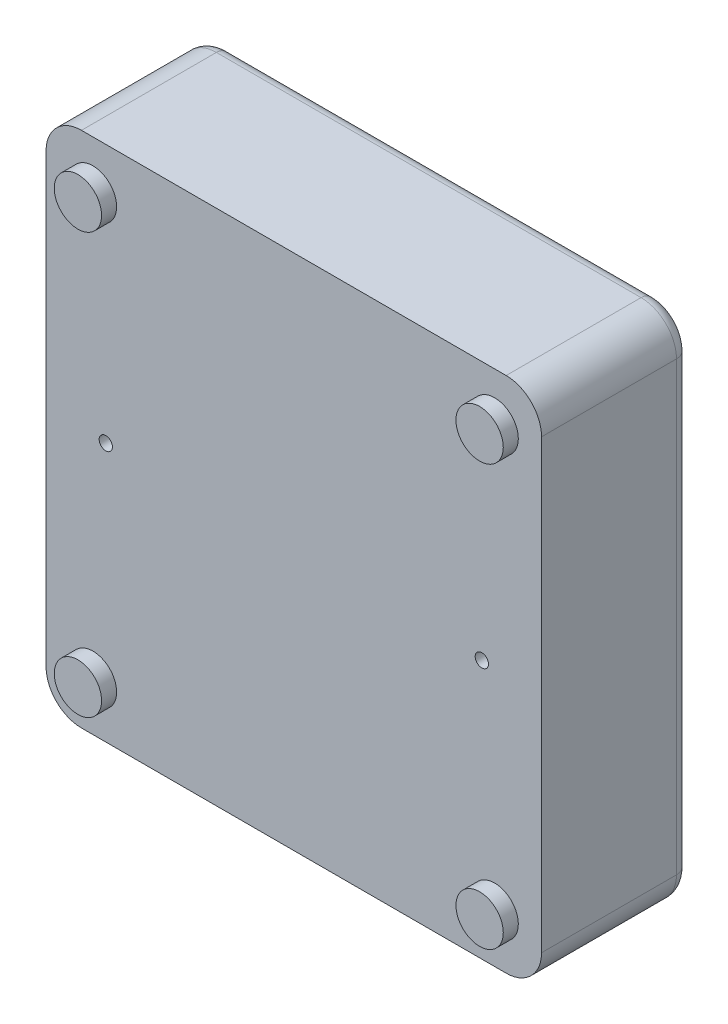
ISO-10303-21;
HEADER;
FILE_DESCRIPTION(('STEP AP214'),'2;1');
FILE_NAME('part.step','',(''),(''),'','','');
FILE_SCHEMA(('AUTOMOTIVE_DESIGN { 1 0 10303 214 1 1 1 1 }'));
ENDSEC;
DATA;
#1=APPLICATION_CONTEXT('core data for automotive mechanical design processes');
#2=APPLICATION_PROTOCOL_DEFINITION('international standard','automotive_design',2000,#1);
#3=PRODUCT_CONTEXT('',#1,'mechanical');
#4=PRODUCT('Part','Part','',(#3));
#5=PRODUCT_RELATED_PRODUCT_CATEGORY('part','',(#4));
#6=PRODUCT_DEFINITION_FORMATION('','',#4);
#7=PRODUCT_DEFINITION_CONTEXT('part definition',#1,'design');
#8=PRODUCT_DEFINITION('design','',#6,#7);
#9=PRODUCT_DEFINITION_SHAPE('','',#8);
#10=(LENGTH_UNIT() NAMED_UNIT(*) SI_UNIT(.MILLI.,.METRE.));
#11=(NAMED_UNIT(*) PLANE_ANGLE_UNIT() SI_UNIT($,.RADIAN.));
#12=(NAMED_UNIT(*) SI_UNIT($,.STERADIAN.) SOLID_ANGLE_UNIT());
#13=UNCERTAINTY_MEASURE_WITH_UNIT(LENGTH_MEASURE(1.E-05),#10,'distance_accuracy_value','');
#14=(GEOMETRIC_REPRESENTATION_CONTEXT(3) GLOBAL_UNCERTAINTY_ASSIGNED_CONTEXT((#13)) GLOBAL_UNIT_ASSIGNED_CONTEXT((#10,
#11,#12)) REPRESENTATION_CONTEXT('',''));
#15=CARTESIAN_POINT('',(0.,0.,0.));
#16=DIRECTION('',(0.,0.,1.));
#17=DIRECTION('',(1.,0.,0.));
#18=AXIS2_PLACEMENT_3D('',#15,#16,#17);
#19=CARTESIAN_POINT('',(-173.832945125788,65.178161231761,33.5));
#20=DIRECTION('',(1.,0.,0.));
#21=DIRECTION('',(0.,1.,0.));
#22=AXIS2_PLACEMENT_3D('',#19,#20,#21);
#23=PLANE('',#22);
#24=DIRECTION('',(0.,0.,-1.));
#25=VECTOR('',#24,1.);
#26=CARTESIAN_POINT('',(-173.832945125788,57.178161231761,33.5));
#27=LINE('',#26,#25);
#28=CARTESIAN_POINT('',(-173.832945125788,57.178161231761,33.5));
#29=VERTEX_POINT('',#28);
#30=CARTESIAN_POINT('',(-173.832945125788,57.178161231761,3.));
#31=VERTEX_POINT('',#30);
#32=EDGE_CURVE('E162',#29,#31,#27,.T.);
#33=ORIENTED_EDGE('',*,*,#32,.T.);
#34=DIRECTION('',(0.,-1.,0.));
#35=VECTOR('',#34,1.);
#36=CARTESIAN_POINT('',(-173.832945125788,65.178161231761,3.));
#37=LINE('',#36,#35);
#38=CARTESIAN_POINT('',(-173.832945125788,-43.821838768239,3.));
#39=VERTEX_POINT('',#38);
#40=EDGE_CURVE('E194',#31,#39,#37,.T.);
#41=ORIENTED_EDGE('',*,*,#40,.T.);
#42=DIRECTION('',(0.,0.,-1.));
#43=VECTOR('',#42,1.);
#44=CARTESIAN_POINT('',(-173.832945125788,-43.821838768239,33.5));
#45=LINE('',#44,#43);
#46=CARTESIAN_POINT('',(-173.832945125788,-43.821838768239,33.5));
#47=VERTEX_POINT('',#46);
#48=EDGE_CURVE('E138',#39,#47,#45,.F.);
#49=ORIENTED_EDGE('',*,*,#48,.T.);
#50=DIRECTION('',(0.,-1.,0.));
#51=VECTOR('',#50,1.);
#52=CARTESIAN_POINT('',(-173.832945125788,65.178161231761,33.5));
#53=LINE('',#52,#51);
#54=EDGE_CURVE('E257',#29,#47,#53,.T.);
#55=ORIENTED_EDGE('',*,*,#54,.F.);
#56=EDGE_LOOP('',(#33,#41,#49,#55));
#57=FACE_BOUND('',#56,.T.);
#58=ADVANCED_FACE('F40',(#57),#23,.F.);
#59=CARTESIAN_POINT('',(-173.832945125788,-51.821838768239,33.5));
#60=DIRECTION('',(0.,1.,0.));
#61=DIRECTION('',(0.,0.,1.));
#62=AXIS2_PLACEMENT_3D('',#59,#60,#61);
#63=PLANE('',#62);
#64=DIRECTION('',(0.,0.,-1.));
#65=VECTOR('',#64,1.);
#66=CARTESIAN_POINT('',(-165.832945125788,-51.821838768239,33.5));
#67=LINE('',#66,#65);
#68=CARTESIAN_POINT('',(-165.832945125788,-51.821838768239,33.5));
#69=VERTEX_POINT('',#68);
#70=CARTESIAN_POINT('',(-165.832945125788,-51.821838768239,3.));
#71=VERTEX_POINT('',#70);
#72=EDGE_CURVE('E167',#69,#71,#67,.T.);
#73=ORIENTED_EDGE('',*,*,#72,.T.);
#74=DIRECTION('',(1.,0.,0.));
#75=VECTOR('',#74,1.);
#76=CARTESIAN_POINT('',(-173.832945125788,-51.821838768239,3.));
#77=LINE('',#76,#75);
#78=CARTESIAN_POINT('',(-69.8329451257883,-51.821838768239,3.));
#79=VERTEX_POINT('',#78);
#80=EDGE_CURVE('E190',#71,#79,#77,.T.);
#81=ORIENTED_EDGE('',*,*,#80,.T.);
#82=DIRECTION('',(0.,0.,-1.));
#83=VECTOR('',#82,1.);
#84=CARTESIAN_POINT('',(-69.8329451257883,-51.821838768239,33.5));
#85=LINE('',#84,#83);
#86=CARTESIAN_POINT('',(-69.8329451257883,-51.821838768239,33.5));
#87=VERTEX_POINT('',#86);
#88=EDGE_CURVE('E165',#79,#87,#85,.F.);
#89=ORIENTED_EDGE('',*,*,#88,.T.);
#90=DIRECTION('',(1.,0.,0.));
#91=VECTOR('',#90,1.);
#92=CARTESIAN_POINT('',(-173.832945125788,-51.821838768239,33.5));
#93=LINE('',#92,#91);
#94=EDGE_CURVE('E268',#69,#87,#93,.T.);
#95=ORIENTED_EDGE('',*,*,#94,.F.);
#96=EDGE_LOOP('',(#73,#81,#89,#95));
#97=FACE_BOUND('',#96,.T.);
#98=ADVANCED_FACE('F310',(#97),#63,.F.);
#99=CARTESIAN_POINT('',(-61.8329451257883,65.178161231761,33.5));
#100=DIRECTION('',(-1.,0.,0.));
#101=DIRECTION('',(0.,-1.,0.));
#102=AXIS2_PLACEMENT_3D('',#99,#100,#101);
#103=PLANE('',#102);
#104=DIRECTION('',(0.,0.,-1.));
#105=VECTOR('',#104,1.);
#106=CARTESIAN_POINT('',(-61.8329451257883,-43.821838768239,33.5));
#107=LINE('',#106,#105);
#108=CARTESIAN_POINT('',(-61.8329451257883,-43.821838768239,33.5));
#109=VERTEX_POINT('',#108);
#110=CARTESIAN_POINT('',(-61.8329451257883,-43.821838768239,3.));
#111=VERTEX_POINT('',#110);
#112=EDGE_CURVE('E149',#109,#111,#107,.T.);
#113=ORIENTED_EDGE('',*,*,#112,.T.);
#114=DIRECTION('',(0.,1.,0.));
#115=VECTOR('',#114,1.);
#116=CARTESIAN_POINT('',(-61.8329451257883,65.178161231761,3.));
#117=LINE('',#116,#115);
#118=CARTESIAN_POINT('',(-61.8329451257883,57.178161231761,3.));
#119=VERTEX_POINT('',#118);
#120=EDGE_CURVE('E11',#111,#119,#117,.T.);
#121=ORIENTED_EDGE('',*,*,#120,.T.);
#122=DIRECTION('',(0.,0.,-1.));
#123=VECTOR('',#122,1.);
#124=CARTESIAN_POINT('',(-61.8329451257883,57.178161231761,33.5));
#125=LINE('',#124,#123);
#126=CARTESIAN_POINT('',(-61.8329451257883,57.178161231761,33.5));
#127=VERTEX_POINT('',#126);
#128=EDGE_CURVE('E151',#119,#127,#125,.F.);
#129=ORIENTED_EDGE('',*,*,#128,.T.);
#130=DIRECTION('',(0.,1.,0.));
#131=VECTOR('',#130,1.);
#132=CARTESIAN_POINT('',(-61.8329451257883,65.178161231761,33.5));
#133=LINE('',#132,#131);
#134=EDGE_CURVE('E137',#109,#127,#133,.T.);
#135=ORIENTED_EDGE('',*,*,#134,.F.);
#136=EDGE_LOOP('',(#113,#121,#129,#135));
#137=FACE_BOUND('',#136,.T.);
#138=ADVANCED_FACE('F281',(#137),#103,.F.);
#139=CARTESIAN_POINT('',(-173.832945125788,65.178161231761,33.5));
#140=DIRECTION('',(0.,-1.,0.));
#141=DIRECTION('',(0.,0.,-1.));
#142=AXIS2_PLACEMENT_3D('',#139,#140,#141);
#143=PLANE('',#142);
#144=DIRECTION('',(0.,0.,-1.));
#145=VECTOR('',#144,1.);
#146=CARTESIAN_POINT('',(-69.8329451257883,65.178161231761,33.5));
#147=LINE('',#146,#145);
#148=CARTESIAN_POINT('',(-69.8329451257883,65.178161231761,33.5));
#149=VERTEX_POINT('',#148);
#150=CARTESIAN_POINT('',(-69.8329451257883,65.178161231761,3.));
#151=VERTEX_POINT('',#150);
#152=EDGE_CURVE('E143',#149,#151,#147,.T.);
#153=ORIENTED_EDGE('',*,*,#152,.T.);
#154=DIRECTION('',(-1.,0.,0.));
#155=VECTOR('',#154,1.);
#156=CARTESIAN_POINT('',(-173.832945125788,65.178161231761,3.));
#157=LINE('',#156,#155);
#158=CARTESIAN_POINT('',(-165.832945125788,65.178161231761,3.));
#159=VERTEX_POINT('',#158);
#160=EDGE_CURVE('E198',#151,#159,#157,.T.);
#161=ORIENTED_EDGE('',*,*,#160,.T.);
#162=DIRECTION('',(0.,0.,-1.));
#163=VECTOR('',#162,1.);
#164=CARTESIAN_POINT('',(-165.832945125788,65.178161231761,33.5));
#165=LINE('',#164,#163);
#166=CARTESIAN_POINT('',(-165.832945125788,65.178161231761,33.5));
#167=VERTEX_POINT('',#166);
#168=EDGE_CURVE('E146',#159,#167,#165,.F.);
#169=ORIENTED_EDGE('',*,*,#168,.T.);
#170=DIRECTION('',(-1.,0.,0.));
#171=VECTOR('',#170,1.);
#172=CARTESIAN_POINT('',(-173.832945125788,65.178161231761,33.5));
#173=LINE('',#172,#171);
#174=EDGE_CURVE('E134',#149,#167,#173,.T.);
#175=ORIENTED_EDGE('',*,*,#174,.F.);
#176=EDGE_LOOP('',(#153,#161,#169,#175));
#177=FACE_BOUND('',#176,.T.);
#178=ADVANCED_FACE('F142',(#177),#143,.F.);
#179=CARTESIAN_POINT('',(0.,0.,33.5));
#180=DIRECTION('',(0.,0.,1.));
#181=DIRECTION('',(1.,0.,0.));
#182=AXIS2_PLACEMENT_3D('',#179,#180,#181);
#183=PLANE('',#182);
#184=CARTESIAN_POINT('',(-72.4329451257883,54.178161231761,33.5));
#185=DIRECTION('',(0.,0.,1.));
#186=DIRECTION('',(1.,0.,0.));
#187=AXIS2_PLACEMENT_3D('',#184,#185,#186);
#188=CIRCLE('',#187,5.35);
#189=CARTESIAN_POINT('',(-67.0829451257883,54.178161231761,33.5));
#190=VERTEX_POINT('',#189);
#191=EDGE_CURVE('E228',#190,#190,#188,.T.);
#192=ORIENTED_EDGE('',*,*,#191,.F.);
#193=EDGE_LOOP('',(#192));
#194=FACE_BOUND('',#193,.T.);
#195=CARTESIAN_POINT('',(-163.232945125788,54.178161231761,33.5));
#196=DIRECTION('',(0.,0.,1.));
#197=DIRECTION('',(1.,0.,0.));
#198=AXIS2_PLACEMENT_3D('',#195,#196,#197);
#199=CIRCLE('',#198,5.35);
#200=CARTESIAN_POINT('',(-157.882945125788,54.178161231761,33.5));
#201=VERTEX_POINT('',#200);
#202=EDGE_CURVE('E236',#201,#201,#199,.T.);
#203=ORIENTED_EDGE('',*,*,#202,.F.);
#204=EDGE_LOOP('',(#203));
#205=FACE_BOUND('',#204,.T.);
#206=CARTESIAN_POINT('',(-163.232945125788,-40.821838768239,33.5));
#207=DIRECTION('',(0.,0.,1.));
#208=DIRECTION('',(1.,0.,0.));
#209=AXIS2_PLACEMENT_3D('',#206,#207,#208);
#210=CIRCLE('',#209,5.35);
#211=CARTESIAN_POINT('',(-157.882945125788,-40.821838768239,33.5));
#212=VERTEX_POINT('',#211);
#213=EDGE_CURVE('E242',#212,#212,#210,.T.);
#214=ORIENTED_EDGE('',*,*,#213,.F.);
#215=EDGE_LOOP('',(#214));
#216=FACE_BOUND('',#215,.T.);
#217=CARTESIAN_POINT('',(-72.4329451257883,-40.821838768239,33.5));
#218=DIRECTION('',(0.,0.,1.));
#219=DIRECTION('',(1.,0.,0.));
#220=AXIS2_PLACEMENT_3D('',#217,#218,#219);
#221=CIRCLE('',#220,5.35);
#222=CARTESIAN_POINT('',(-67.0829451257883,-40.821838768239,33.5));
#223=VERTEX_POINT('',#222);
#224=EDGE_CURVE('E245',#223,#223,#221,.T.);
#225=ORIENTED_EDGE('',*,*,#224,.F.);
#226=EDGE_LOOP('',(#225));
#227=FACE_BOUND('',#226,.T.);
#228=CARTESIAN_POINT('',(-75.3329451257883,6.678161231761,33.5));
#229=DIRECTION('',(0.,0.,1.));
#230=DIRECTION('',(1.,0.,0.));
#231=AXIS2_PLACEMENT_3D('',#228,#229,#230);
#232=CIRCLE('',#231,1.5);
#233=CARTESIAN_POINT('',(-73.8329451257883,6.678161231761,33.5));
#234=VERTEX_POINT('',#233);
#235=EDGE_CURVE('E258',#234,#234,#232,.T.);
#236=ORIENTED_EDGE('',*,*,#235,.F.);
#237=EDGE_LOOP('',(#236));
#238=FACE_BOUND('',#237,.T.);
#239=CARTESIAN_POINT('',(-160.332945125788,6.678161231761,33.5));
#240=DIRECTION('',(0.,0.,1.));
#241=DIRECTION('',(1.,0.,0.));
#242=AXIS2_PLACEMENT_3D('',#239,#240,#241);
#243=CIRCLE('',#242,1.5);
#244=CARTESIAN_POINT('',(-158.832945125788,6.678161231761,33.5));
#245=VERTEX_POINT('',#244);
#246=EDGE_CURVE('E261',#245,#245,#243,.T.);
#247=ORIENTED_EDGE('',*,*,#246,.F.);
#248=EDGE_LOOP('',(#247));
#249=FACE_BOUND('',#248,.T.);
#250=ORIENTED_EDGE('',*,*,#134,.T.);
#251=CARTESIAN_POINT('',(-69.8329451257883,57.178161231761,33.5));
#252=DIRECTION('',(0.,0.,1.));
#253=DIRECTION('',(1.,0.,0.));
#254=AXIS2_PLACEMENT_3D('',#251,#252,#253);
#255=CIRCLE('',#254,8.);
#256=EDGE_CURVE('E131',#127,#149,#255,.T.);
#257=ORIENTED_EDGE('',*,*,#256,.T.);
#258=ORIENTED_EDGE('',*,*,#174,.T.);
#259=CARTESIAN_POINT('',(-165.832945125788,57.178161231761,33.5));
#260=DIRECTION('',(0.,0.,1.));
#261=DIRECTION('',(1.,0.,0.));
#262=AXIS2_PLACEMENT_3D('',#259,#260,#261);
#263=CIRCLE('',#262,8.);
#264=EDGE_CURVE('E139',#167,#29,#263,.T.);
#265=ORIENTED_EDGE('',*,*,#264,.T.);
#266=ORIENTED_EDGE('',*,*,#54,.T.);
#267=CARTESIAN_POINT('',(-165.832945125788,-43.821838768239,33.5));
#268=DIRECTION('',(0.,0.,1.));
#269=DIRECTION('',(1.,0.,0.));
#270=AXIS2_PLACEMENT_3D('',#267,#268,#269);
#271=CIRCLE('',#270,8.);
#272=EDGE_CURVE('E158',#47,#69,#271,.T.);
#273=ORIENTED_EDGE('',*,*,#272,.T.);
#274=ORIENTED_EDGE('',*,*,#94,.T.);
#275=CARTESIAN_POINT('',(-69.8329451257883,-43.821838768239,33.5));
#276=DIRECTION('',(0.,0.,1.));
#277=DIRECTION('',(1.,0.,0.));
#278=AXIS2_PLACEMENT_3D('',#275,#276,#277);
#279=CIRCLE('',#278,8.);
#280=EDGE_CURVE('E156',#87,#109,#279,.T.);
#281=ORIENTED_EDGE('',*,*,#280,.T.);
#282=EDGE_LOOP('',(#250,#257,#258,#265,#266,#273,#274,#281));
#283=FACE_BOUND('',#282,.T.);
#284=ADVANCED_FACE('F133',(#194,#205,#216,#227,#238,#249,#283),#183,.T.);
#285=CARTESIAN_POINT('',(0.,0.,0.));
#286=DIRECTION('',(0.,0.,1.));
#287=DIRECTION('',(1.,0.,0.));
#288=AXIS2_PLACEMENT_3D('',#285,#286,#287);
#289=PLANE('',#288);
#290=DIRECTION('',(0.,1.,0.));
#291=VECTOR('',#290,1.);
#292=CARTESIAN_POINT('',(-64.8329451257883,0.,0.));
#293=LINE('',#292,#291);
#294=CARTESIAN_POINT('',(-64.8329451257883,57.178161231761,0.));
#295=VERTEX_POINT('',#294);
#296=CARTESIAN_POINT('',(-64.8329451257883,-43.821838768239,0.));
#297=VERTEX_POINT('',#296);
#298=EDGE_CURVE('E170',#295,#297,#293,.F.);
#299=ORIENTED_EDGE('',*,*,#298,.T.);
#300=CARTESIAN_POINT('',(-69.8329451257883,-43.821838768239,0.));
#301=DIRECTION('',(0.,0.,1.));
#302=DIRECTION('',(1.,0.,0.));
#303=AXIS2_PLACEMENT_3D('',#300,#301,#302);
#304=CIRCLE('',#303,5.);
#305=CARTESIAN_POINT('',(-69.8329451257883,-48.821838768239,0.));
#306=VERTEX_POINT('',#305);
#307=EDGE_CURVE('E184',#297,#306,#304,.F.);
#308=ORIENTED_EDGE('',*,*,#307,.T.);
#309=DIRECTION('',(1.,0.,0.));
#310=VECTOR('',#309,1.);
#311=CARTESIAN_POINT('',(0.,-48.821838768239,0.));
#312=LINE('',#311,#310);
#313=CARTESIAN_POINT('',(-165.832945125788,-48.821838768239,0.));
#314=VERTEX_POINT('',#313);
#315=EDGE_CURVE('E182',#306,#314,#312,.F.);
#316=ORIENTED_EDGE('',*,*,#315,.T.);
#317=CARTESIAN_POINT('',(-165.832945125788,-43.821838768239,0.));
#318=DIRECTION('',(0.,0.,1.));
#319=DIRECTION('',(1.,0.,0.));
#320=AXIS2_PLACEMENT_3D('',#317,#318,#319);
#321=CIRCLE('',#320,5.);
#322=CARTESIAN_POINT('',(-170.832945125788,-43.821838768239,0.));
#323=VERTEX_POINT('',#322);
#324=EDGE_CURVE('E180',#314,#323,#321,.F.);
#325=ORIENTED_EDGE('',*,*,#324,.T.);
#326=DIRECTION('',(0.,-1.,0.));
#327=VECTOR('',#326,1.);
#328=CARTESIAN_POINT('',(-170.832945125788,0.,0.));
#329=LINE('',#328,#327);
#330=CARTESIAN_POINT('',(-170.832945125788,57.178161231761,0.));
#331=VERTEX_POINT('',#330);
#332=EDGE_CURVE('E178',#323,#331,#329,.F.);
#333=ORIENTED_EDGE('',*,*,#332,.T.);
#334=CARTESIAN_POINT('',(-165.832945125788,57.178161231761,0.));
#335=DIRECTION('',(0.,0.,1.));
#336=DIRECTION('',(1.,0.,0.));
#337=AXIS2_PLACEMENT_3D('',#334,#335,#336);
#338=CIRCLE('',#337,5.);
#339=CARTESIAN_POINT('',(-165.832945125788,62.178161231761,0.));
#340=VERTEX_POINT('',#339);
#341=EDGE_CURVE('E176',#331,#340,#338,.F.);
#342=ORIENTED_EDGE('',*,*,#341,.T.);
#343=DIRECTION('',(-1.,0.,0.));
#344=VECTOR('',#343,1.);
#345=CARTESIAN_POINT('',(0.,62.178161231761,0.));
#346=LINE('',#345,#344);
#347=CARTESIAN_POINT('',(-69.8329451257883,62.178161231761,0.));
#348=VERTEX_POINT('',#347);
#349=EDGE_CURVE('E174',#340,#348,#346,.F.);
#350=ORIENTED_EDGE('',*,*,#349,.T.);
#351=CARTESIAN_POINT('',(-69.8329451257883,57.178161231761,0.));
#352=DIRECTION('',(0.,0.,1.));
#353=DIRECTION('',(1.,0.,0.));
#354=AXIS2_PLACEMENT_3D('',#351,#352,#353);
#355=CIRCLE('',#354,5.);
#356=EDGE_CURVE('E172',#348,#295,#355,.F.);
#357=ORIENTED_EDGE('',*,*,#356,.T.);
#358=EDGE_LOOP('',(#299,#308,#316,#325,#333,#342,#350,#357));
#359=FACE_BOUND('',#358,.T.);
#360=ADVANCED_FACE('F293',(#359),#289,.F.);
#361=CARTESIAN_POINT('',(-69.8329451257883,57.178161231761,33.5));
#362=DIRECTION('',(0.,0.,-1.));
#363=DIRECTION('',(-1.,0.,0.));
#364=AXIS2_PLACEMENT_3D('',#361,#362,#363);
#365=CYLINDRICAL_SURFACE('',#364,8.);
#366=ORIENTED_EDGE('',*,*,#128,.F.);
#367=CARTESIAN_POINT('',(-69.8329451257883,57.178161231761,3.));
#368=DIRECTION('',(0.,0.,1.));
#369=DIRECTION('',(1.,0.,0.));
#370=AXIS2_PLACEMENT_3D('',#367,#368,#369);
#371=CIRCLE('',#370,8.);
#372=EDGE_CURVE('E49',#119,#151,#371,.T.);
#373=ORIENTED_EDGE('',*,*,#372,.T.);
#374=ORIENTED_EDGE('',*,*,#152,.F.);
#375=ORIENTED_EDGE('',*,*,#256,.F.);
#376=EDGE_LOOP('',(#366,#373,#374,#375));
#377=FACE_BOUND('',#376,.T.);
#378=ADVANCED_FACE('F148',(#377),#365,.T.);
#379=CARTESIAN_POINT('',(-165.832945125788,57.178161231761,33.5));
#380=DIRECTION('',(0.,0.,-1.));
#381=DIRECTION('',(-1.,0.,0.));
#382=AXIS2_PLACEMENT_3D('',#379,#380,#381);
#383=CYLINDRICAL_SURFACE('',#382,8.);
#384=ORIENTED_EDGE('',*,*,#168,.F.);
#385=CARTESIAN_POINT('',(-165.832945125788,57.178161231761,3.));
#386=DIRECTION('',(0.,0.,1.));
#387=DIRECTION('',(1.,0.,0.));
#388=AXIS2_PLACEMENT_3D('',#385,#386,#387);
#389=CIRCLE('',#388,8.);
#390=EDGE_CURVE('E196',#159,#31,#389,.T.);
#391=ORIENTED_EDGE('',*,*,#390,.T.);
#392=ORIENTED_EDGE('',*,*,#32,.F.);
#393=ORIENTED_EDGE('',*,*,#264,.F.);
#394=EDGE_LOOP('',(#384,#391,#392,#393));
#395=FACE_BOUND('',#394,.T.);
#396=ADVANCED_FACE('F298',(#395),#383,.T.);
#397=CARTESIAN_POINT('',(-165.832945125788,-43.821838768239,33.5));
#398=DIRECTION('',(0.,0.,-1.));
#399=DIRECTION('',(-1.,0.,0.));
#400=AXIS2_PLACEMENT_3D('',#397,#398,#399);
#401=CYLINDRICAL_SURFACE('',#400,8.);
#402=ORIENTED_EDGE('',*,*,#48,.F.);
#403=CARTESIAN_POINT('',(-165.832945125788,-43.821838768239,3.));
#404=DIRECTION('',(0.,0.,1.));
#405=DIRECTION('',(1.,0.,0.));
#406=AXIS2_PLACEMENT_3D('',#403,#404,#405);
#407=CIRCLE('',#406,8.);
#408=EDGE_CURVE('E192',#39,#71,#407,.T.);
#409=ORIENTED_EDGE('',*,*,#408,.T.);
#410=ORIENTED_EDGE('',*,*,#72,.F.);
#411=ORIENTED_EDGE('',*,*,#272,.F.);
#412=EDGE_LOOP('',(#402,#409,#410,#411));
#413=FACE_BOUND('',#412,.T.);
#414=ADVANCED_FACE('F308',(#413),#401,.T.);
#415=CARTESIAN_POINT('',(-69.8329451257883,-43.821838768239,33.5));
#416=DIRECTION('',(0.,0.,-1.));
#417=DIRECTION('',(-1.,0.,0.));
#418=AXIS2_PLACEMENT_3D('',#415,#416,#417);
#419=CYLINDRICAL_SURFACE('',#418,8.);
#420=ORIENTED_EDGE('',*,*,#88,.F.);
#421=CARTESIAN_POINT('',(-69.8329451257883,-43.821838768239,3.));
#422=DIRECTION('',(0.,0.,1.));
#423=DIRECTION('',(1.,0.,0.));
#424=AXIS2_PLACEMENT_3D('',#421,#422,#423);
#425=CIRCLE('',#424,8.);
#426=EDGE_CURVE('E187',#79,#111,#425,.T.);
#427=ORIENTED_EDGE('',*,*,#426,.T.);
#428=ORIENTED_EDGE('',*,*,#112,.F.);
#429=ORIENTED_EDGE('',*,*,#280,.F.);
#430=EDGE_LOOP('',(#420,#427,#428,#429));
#431=FACE_BOUND('',#430,.T.);
#432=ADVANCED_FACE('F279',(#431),#419,.T.);
#433=CARTESIAN_POINT('',(-160.332945125788,6.678161231761,30.5));
#434=DIRECTION('',(0.,0.,1.));
#435=DIRECTION('',(1.,0.,0.));
#436=AXIS2_PLACEMENT_3D('',#433,#434,#435);
#437=CYLINDRICAL_SURFACE('',#436,1.5);
#438=CARTESIAN_POINT('',(-160.332945125788,6.678161231761,30.5));
#439=DIRECTION('',(0.,0.,1.));
#440=DIRECTION('',(1.,0.,0.));
#441=AXIS2_PLACEMENT_3D('',#438,#439,#440);
#442=CIRCLE('',#441,1.5);
#443=CARTESIAN_POINT('',(-158.832945125788,6.678161231761,30.5));
#444=VERTEX_POINT('',#443);
#445=EDGE_CURVE('E251',#444,#444,#442,.T.);
#446=ORIENTED_EDGE('',*,*,#445,.F.);
#447=EDGE_LOOP('',(#446));
#448=FACE_BOUND('',#447,.T.);
#449=ORIENTED_EDGE('',*,*,#246,.T.);
#450=EDGE_LOOP('',(#449));
#451=FACE_BOUND('',#450,.T.);
#452=ADVANCED_FACE('F342',(#448,#451),#437,.F.);
#453=CARTESIAN_POINT('',(-160.332945125788,6.678161231761,30.5));
#454=DIRECTION('',(0.,0.,1.));
#455=DIRECTION('',(1.,0.,0.));
#456=AXIS2_PLACEMENT_3D('',#453,#454,#455);
#457=PLANE('',#456);
#458=ORIENTED_EDGE('',*,*,#445,.T.);
#459=EDGE_LOOP('',(#458));
#460=FACE_BOUND('',#459,.T.);
#461=ADVANCED_FACE('F346',(#460),#457,.T.);
#462=CARTESIAN_POINT('',(-75.3329451257883,6.678161231761,30.5));
#463=DIRECTION('',(0.,0.,1.));
#464=DIRECTION('',(1.,0.,0.));
#465=AXIS2_PLACEMENT_3D('',#462,#463,#464);
#466=CYLINDRICAL_SURFACE('',#465,1.5);
#467=CARTESIAN_POINT('',(-75.3329451257883,6.678161231761,30.5));
#468=DIRECTION('',(0.,0.,1.));
#469=DIRECTION('',(1.,0.,0.));
#470=AXIS2_PLACEMENT_3D('',#467,#468,#469);
#471=CIRCLE('',#470,1.5);
#472=CARTESIAN_POINT('',(-73.8329451257883,6.678161231761,30.5));
#473=VERTEX_POINT('',#472);
#474=EDGE_CURVE('E254',#473,#473,#471,.T.);
#475=ORIENTED_EDGE('',*,*,#474,.F.);
#476=EDGE_LOOP('',(#475));
#477=FACE_BOUND('',#476,.T.);
#478=ORIENTED_EDGE('',*,*,#235,.T.);
#479=EDGE_LOOP('',(#478));
#480=FACE_BOUND('',#479,.T.);
#481=ADVANCED_FACE('F352',(#477,#480),#466,.F.);
#482=CARTESIAN_POINT('',(-75.3329451257883,6.678161231761,30.5));
#483=DIRECTION('',(0.,0.,1.));
#484=DIRECTION('',(1.,0.,0.));
#485=AXIS2_PLACEMENT_3D('',#482,#483,#484);
#486=PLANE('',#485);
#487=ORIENTED_EDGE('',*,*,#474,.T.);
#488=EDGE_LOOP('',(#487));
#489=FACE_BOUND('',#488,.T.);
#490=ADVANCED_FACE('F563',(#489),#486,.T.);
#491=CARTESIAN_POINT('',(-72.4329451257883,-40.821838768239,36.9));
#492=DIRECTION('',(0.,0.,-1.));
#493=DIRECTION('',(-1.,0.,0.));
#494=AXIS2_PLACEMENT_3D('',#491,#492,#493);
#495=CYLINDRICAL_SURFACE('',#494,5.35);
#496=CARTESIAN_POINT('',(-72.4329451257883,-40.821838768239,36.9));
#497=DIRECTION('',(0.,0.,1.));
#498=DIRECTION('',(1.,0.,0.));
#499=AXIS2_PLACEMENT_3D('',#496,#497,#498);
#500=CIRCLE('',#499,5.35);
#501=CARTESIAN_POINT('',(-67.0829451257883,-40.821838768239,36.9));
#502=VERTEX_POINT('',#501);
#503=EDGE_CURVE('E248',#502,#502,#500,.T.);
#504=ORIENTED_EDGE('',*,*,#503,.F.);
#505=EDGE_LOOP('',(#504));
#506=FACE_BOUND('',#505,.T.);
#507=ORIENTED_EDGE('',*,*,#224,.T.);
#508=EDGE_LOOP('',(#507));
#509=FACE_BOUND('',#508,.T.);
#510=ADVANCED_FACE('F553',(#506,#509),#495,.T.);
#511=CARTESIAN_POINT('',(-72.4329451257883,-40.821838768239,36.9));
#512=DIRECTION('',(0.,0.,1.));
#513=DIRECTION('',(1.,0.,0.));
#514=AXIS2_PLACEMENT_3D('',#511,#512,#513);
#515=PLANE('',#514);
#516=ORIENTED_EDGE('',*,*,#503,.T.);
#517=EDGE_LOOP('',(#516));
#518=FACE_BOUND('',#517,.T.);
#519=ADVANCED_FACE('F543',(#518),#515,.T.);
#520=CARTESIAN_POINT('',(-163.232945125788,-40.821838768239,36.9));
#521=DIRECTION('',(0.,0.,-1.));
#522=DIRECTION('',(-1.,0.,0.));
#523=AXIS2_PLACEMENT_3D('',#520,#521,#522);
#524=CYLINDRICAL_SURFACE('',#523,5.35);
#525=CARTESIAN_POINT('',(-163.232945125788,-40.821838768239,36.9));
#526=DIRECTION('',(0.,0.,1.));
#527=DIRECTION('',(1.,0.,0.));
#528=AXIS2_PLACEMENT_3D('',#525,#526,#527);
#529=CIRCLE('',#528,5.35);
#530=CARTESIAN_POINT('',(-157.882945125788,-40.821838768239,36.9));
#531=VERTEX_POINT('',#530);
#532=EDGE_CURVE('E239',#531,#531,#529,.T.);
#533=ORIENTED_EDGE('',*,*,#532,.F.);
#534=EDGE_LOOP('',(#533));
#535=FACE_BOUND('',#534,.T.);
#536=ORIENTED_EDGE('',*,*,#213,.T.);
#537=EDGE_LOOP('',(#536));
#538=FACE_BOUND('',#537,.T.);
#539=ADVANCED_FACE('F533',(#535,#538),#524,.T.);
#540=CARTESIAN_POINT('',(-163.232945125788,-40.821838768239,36.9));
#541=DIRECTION('',(0.,0.,1.));
#542=DIRECTION('',(1.,0.,0.));
#543=AXIS2_PLACEMENT_3D('',#540,#541,#542);
#544=PLANE('',#543);
#545=ORIENTED_EDGE('',*,*,#532,.T.);
#546=EDGE_LOOP('',(#545));
#547=FACE_BOUND('',#546,.T.);
#548=ADVANCED_FACE('F523',(#547),#544,.T.);
#549=CARTESIAN_POINT('',(-163.232945125788,54.178161231761,36.9));
#550=DIRECTION('',(0.,0.,-1.));
#551=DIRECTION('',(-1.,0.,0.));
#552=AXIS2_PLACEMENT_3D('',#549,#550,#551);
#553=CYLINDRICAL_SURFACE('',#552,5.35);
#554=CARTESIAN_POINT('',(-163.232945125788,54.178161231761,36.9));
#555=DIRECTION('',(0.,0.,1.));
#556=DIRECTION('',(1.,0.,0.));
#557=AXIS2_PLACEMENT_3D('',#554,#555,#556);
#558=CIRCLE('',#557,5.35);
#559=CARTESIAN_POINT('',(-157.882945125788,54.178161231761,36.9));
#560=VERTEX_POINT('',#559);
#561=EDGE_CURVE('E233',#560,#560,#558,.T.);
#562=ORIENTED_EDGE('',*,*,#561,.F.);
#563=EDGE_LOOP('',(#562));
#564=FACE_BOUND('',#563,.T.);
#565=ORIENTED_EDGE('',*,*,#202,.T.);
#566=EDGE_LOOP('',(#565));
#567=FACE_BOUND('',#566,.T.);
#568=ADVANCED_FACE('F513',(#564,#567),#553,.T.);
#569=CARTESIAN_POINT('',(-163.232945125788,54.178161231761,36.9));
#570=DIRECTION('',(0.,0.,1.));
#571=DIRECTION('',(1.,0.,0.));
#572=AXIS2_PLACEMENT_3D('',#569,#570,#571);
#573=PLANE('',#572);
#574=ORIENTED_EDGE('',*,*,#561,.T.);
#575=EDGE_LOOP('',(#574));
#576=FACE_BOUND('',#575,.T.);
#577=ADVANCED_FACE('F503',(#576),#573,.T.);
#578=CARTESIAN_POINT('',(-72.4329451257883,54.178161231761,36.9));
#579=DIRECTION('',(0.,0.,-1.));
#580=DIRECTION('',(-1.,0.,0.));
#581=AXIS2_PLACEMENT_3D('',#578,#579,#580);
#582=CYLINDRICAL_SURFACE('',#581,5.35);
#583=CARTESIAN_POINT('',(-72.4329451257883,54.178161231761,36.9));
#584=DIRECTION('',(0.,0.,1.));
#585=DIRECTION('',(1.,0.,0.));
#586=AXIS2_PLACEMENT_3D('',#583,#584,#585);
#587=CIRCLE('',#586,5.35);
#588=CARTESIAN_POINT('',(-67.0829451257883,54.178161231761,36.9));
#589=VERTEX_POINT('',#588);
#590=EDGE_CURVE('E223',#589,#589,#587,.T.);
#591=ORIENTED_EDGE('',*,*,#590,.F.);
#592=EDGE_LOOP('',(#591));
#593=FACE_BOUND('',#592,.T.);
#594=ORIENTED_EDGE('',*,*,#191,.T.);
#595=EDGE_LOOP('',(#594));
#596=FACE_BOUND('',#595,.T.);
#597=ADVANCED_FACE('F494',(#593,#596),#582,.T.);
#598=CARTESIAN_POINT('',(-72.4329451257883,54.178161231761,36.9));
#599=DIRECTION('',(0.,0.,1.));
#600=DIRECTION('',(1.,0.,0.));
#601=AXIS2_PLACEMENT_3D('',#598,#599,#600);
#602=PLANE('',#601);
#603=ORIENTED_EDGE('',*,*,#590,.T.);
#604=EDGE_LOOP('',(#603));
#605=FACE_BOUND('',#604,.T.);
#606=ADVANCED_FACE('F413',(#605),#602,.T.);
#607=CARTESIAN_POINT('',(-165.832945125788,57.178161231761,3.));
#608=DIRECTION('',(0.,0.,1.));
#609=DIRECTION('',(1.,0.,0.));
#610=AXIS2_PLACEMENT_3D('',#607,#608,#609);
#611=TOROIDAL_SURFACE('',#610,5.,3.);
#612=CARTESIAN_POINT('',(-170.832945125788,57.178161231761,3.));
#613=DIRECTION('',(0.,-1.,0.));
#614=DIRECTION('',(0.,0.,-1.));
#615=AXIS2_PLACEMENT_3D('',#612,#613,#614);
#616=CIRCLE('',#615,3.);
#617=EDGE_CURVE('E216',#31,#331,#616,.T.);
#618=ORIENTED_EDGE('',*,*,#617,.F.);
#619=ORIENTED_EDGE('',*,*,#390,.F.);
#620=CARTESIAN_POINT('',(-165.832945125788,62.178161231761,3.));
#621=DIRECTION('',(1.,0.,0.));
#622=DIRECTION('',(0.,0.,-1.));
#623=AXIS2_PLACEMENT_3D('',#620,#621,#622);
#624=CIRCLE('',#623,3.);
#625=EDGE_CURVE('E44',#340,#159,#624,.T.);
#626=ORIENTED_EDGE('',*,*,#625,.F.);
#627=ORIENTED_EDGE('',*,*,#341,.F.);
#628=EDGE_LOOP('',(#618,#619,#626,#627));
#629=FACE_BOUND('',#628,.T.);
#630=ADVANCED_FACE('F42',(#629),#611,.T.);
#631=CARTESIAN_POINT('',(-173.832945125788,62.178161231761,3.));
#632=DIRECTION('',(-1.,0.,0.));
#633=DIRECTION('',(0.,0.,1.));
#634=AXIS2_PLACEMENT_3D('',#631,#632,#633);
#635=CYLINDRICAL_SURFACE('',#634,3.);
#636=ORIENTED_EDGE('',*,*,#625,.T.);
#637=ORIENTED_EDGE('',*,*,#160,.F.);
#638=CARTESIAN_POINT('',(-69.8329451257883,62.178161231761,3.));
#639=DIRECTION('',(1.,0.,0.));
#640=DIRECTION('',(0.,0.,-1.));
#641=AXIS2_PLACEMENT_3D('',#638,#639,#640);
#642=CIRCLE('',#641,3.);
#643=EDGE_CURVE('E214',#348,#151,#642,.T.);
#644=ORIENTED_EDGE('',*,*,#643,.F.);
#645=ORIENTED_EDGE('',*,*,#349,.F.);
#646=EDGE_LOOP('',(#636,#637,#644,#645));
#647=FACE_BOUND('',#646,.T.);
#648=ADVANCED_FACE('F295',(#647),#635,.T.);
#649=CARTESIAN_POINT('',(-170.832945125788,65.178161231761,3.));
#650=DIRECTION('',(0.,-1.,0.));
#651=DIRECTION('',(1.,0.,0.));
#652=AXIS2_PLACEMENT_3D('',#649,#650,#651);
#653=CYLINDRICAL_SURFACE('',#652,3.);
#654=ORIENTED_EDGE('',*,*,#617,.T.);
#655=ORIENTED_EDGE('',*,*,#332,.F.);
#656=CARTESIAN_POINT('',(-170.832945125788,-43.821838768239,3.));
#657=DIRECTION('',(0.,-1.,0.));
#658=DIRECTION('',(0.,0.,-1.));
#659=AXIS2_PLACEMENT_3D('',#656,#657,#658);
#660=CIRCLE('',#659,3.);
#661=EDGE_CURVE('E211',#39,#323,#660,.T.);
#662=ORIENTED_EDGE('',*,*,#661,.F.);
#663=ORIENTED_EDGE('',*,*,#40,.F.);
#664=EDGE_LOOP('',(#654,#655,#662,#663));
#665=FACE_BOUND('',#664,.T.);
#666=ADVANCED_FACE('F302',(#665),#653,.T.);
#667=CARTESIAN_POINT('',(-69.8329451257883,57.178161231761,3.));
#668=DIRECTION('',(0.,0.,1.));
#669=DIRECTION('',(1.,0.,0.));
#670=AXIS2_PLACEMENT_3D('',#667,#668,#669);
#671=TOROIDAL_SURFACE('',#670,5.,3.);
#672=ORIENTED_EDGE('',*,*,#643,.T.);
#673=ORIENTED_EDGE('',*,*,#372,.F.);
#674=CARTESIAN_POINT('',(-64.8329451257883,57.178161231761,3.));
#675=DIRECTION('',(0.,-1.,0.));
#676=DIRECTION('',(0.,0.,-1.));
#677=AXIS2_PLACEMENT_3D('',#674,#675,#676);
#678=CIRCLE('',#677,3.);
#679=EDGE_CURVE('E208',#295,#119,#678,.T.);
#680=ORIENTED_EDGE('',*,*,#679,.F.);
#681=ORIENTED_EDGE('',*,*,#356,.F.);
#682=EDGE_LOOP('',(#672,#673,#680,#681));
#683=FACE_BOUND('',#682,.T.);
#684=ADVANCED_FACE('F284',(#683),#671,.T.);
#685=CARTESIAN_POINT('',(-165.832945125788,-43.821838768239,3.));
#686=DIRECTION('',(0.,0.,1.));
#687=DIRECTION('',(1.,0.,0.));
#688=AXIS2_PLACEMENT_3D('',#685,#686,#687);
#689=TOROIDAL_SURFACE('',#688,5.,3.);
#690=ORIENTED_EDGE('',*,*,#661,.T.);
#691=ORIENTED_EDGE('',*,*,#324,.F.);
#692=CARTESIAN_POINT('',(-165.832945125788,-48.821838768239,3.));
#693=DIRECTION('',(1.,0.,0.));
#694=DIRECTION('',(0.,0.,-1.));
#695=AXIS2_PLACEMENT_3D('',#692,#693,#694);
#696=CIRCLE('',#695,3.);
#697=EDGE_CURVE('E205',#71,#314,#696,.T.);
#698=ORIENTED_EDGE('',*,*,#697,.F.);
#699=ORIENTED_EDGE('',*,*,#408,.F.);
#700=EDGE_LOOP('',(#690,#691,#698,#699));
#701=FACE_BOUND('',#700,.T.);
#702=ADVANCED_FACE('F314',(#701),#689,.T.);
#703=CARTESIAN_POINT('',(-64.8329451257883,65.178161231761,3.));
#704=DIRECTION('',(0.,1.,0.));
#705=DIRECTION('',(-1.,0.,0.));
#706=AXIS2_PLACEMENT_3D('',#703,#704,#705);
#707=CYLINDRICAL_SURFACE('',#706,3.);
#708=ORIENTED_EDGE('',*,*,#679,.T.);
#709=ORIENTED_EDGE('',*,*,#120,.F.);
#710=CARTESIAN_POINT('',(-64.8329451257883,-43.821838768239,3.));
#711=DIRECTION('',(0.,-1.,0.));
#712=DIRECTION('',(0.,0.,-1.));
#713=AXIS2_PLACEMENT_3D('',#710,#711,#712);
#714=CIRCLE('',#713,3.);
#715=EDGE_CURVE('E203',#297,#111,#714,.T.);
#716=ORIENTED_EDGE('',*,*,#715,.F.);
#717=ORIENTED_EDGE('',*,*,#298,.F.);
#718=EDGE_LOOP('',(#708,#709,#716,#717));
#719=FACE_BOUND('',#718,.T.);
#720=ADVANCED_FACE('F289',(#719),#707,.T.);
#721=CARTESIAN_POINT('',(-173.832945125788,-48.821838768239,3.));
#722=DIRECTION('',(1.,0.,0.));
#723=DIRECTION('',(0.,0.,-1.));
#724=AXIS2_PLACEMENT_3D('',#721,#722,#723);
#725=CYLINDRICAL_SURFACE('',#724,3.);
#726=ORIENTED_EDGE('',*,*,#697,.T.);
#727=ORIENTED_EDGE('',*,*,#315,.F.);
#728=CARTESIAN_POINT('',(-69.8329451257883,-48.821838768239,3.));
#729=DIRECTION('',(1.,0.,0.));
#730=DIRECTION('',(0.,0.,-1.));
#731=AXIS2_PLACEMENT_3D('',#728,#729,#730);
#732=CIRCLE('',#731,3.);
#733=EDGE_CURVE('E201',#79,#306,#732,.T.);
#734=ORIENTED_EDGE('',*,*,#733,.F.);
#735=ORIENTED_EDGE('',*,*,#80,.F.);
#736=EDGE_LOOP('',(#726,#727,#734,#735));
#737=FACE_BOUND('',#736,.T.);
#738=ADVANCED_FACE('F318',(#737),#725,.T.);
#739=CARTESIAN_POINT('',(-69.8329451257883,-43.821838768239,3.));
#740=DIRECTION('',(0.,0.,1.));
#741=DIRECTION('',(1.,0.,0.));
#742=AXIS2_PLACEMENT_3D('',#739,#740,#741);
#743=TOROIDAL_SURFACE('',#742,5.,3.);
#744=ORIENTED_EDGE('',*,*,#715,.T.);
#745=ORIENTED_EDGE('',*,*,#426,.F.);
#746=ORIENTED_EDGE('',*,*,#733,.T.);
#747=ORIENTED_EDGE('',*,*,#307,.F.);
#748=EDGE_LOOP('',(#744,#745,#746,#747));
#749=FACE_BOUND('',#748,.T.);
#750=ADVANCED_FACE('F320',(#749),#743,.T.);
#751=CLOSED_SHELL('',(#58,#98,#138,#178,#284,#360,#378,#396,#414,#432,#452,#461,#481,#490,#510,
#519,#539,#548,#568,#577,#597,#606,#630,#648,#666,#684,#702,#720,#738,#750));
#752=MANIFOLD_SOLID_BREP('B2',#751);
#753=ADVANCED_BREP_SHAPE_REPRESENTATION('',(#18,#752),#14);
#754=SHAPE_DEFINITION_REPRESENTATION(#9,#753);
ENDSEC;
END-ISO-10303-21;
